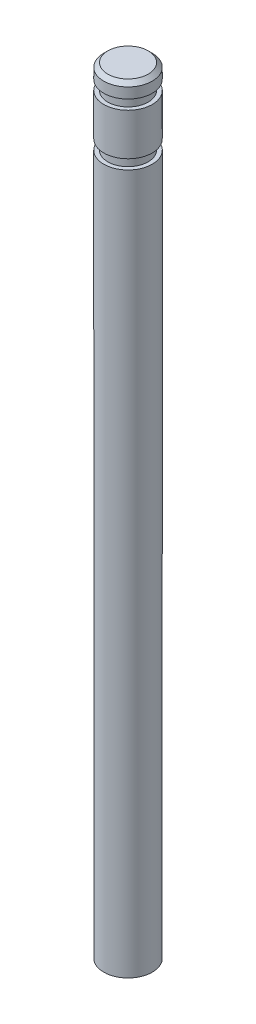
ISO-10303-21;
HEADER;
FILE_DESCRIPTION(('STEP AP214'),'2;1');
FILE_NAME('part.step','',(''),(''),'','','');
FILE_SCHEMA(('AUTOMOTIVE_DESIGN { 1 0 10303 214 1 1 1 1 }'));
ENDSEC;
DATA;
#1=APPLICATION_CONTEXT('core data for automotive mechanical design processes');
#2=APPLICATION_PROTOCOL_DEFINITION('international standard','automotive_design',2000,#1);
#3=PRODUCT_CONTEXT('',#1,'mechanical');
#4=PRODUCT('Part','Part','',(#3));
#5=PRODUCT_RELATED_PRODUCT_CATEGORY('part','',(#4));
#6=PRODUCT_DEFINITION_FORMATION('','',#4);
#7=PRODUCT_DEFINITION_CONTEXT('part definition',#1,'design');
#8=PRODUCT_DEFINITION('design','',#6,#7);
#9=PRODUCT_DEFINITION_SHAPE('','',#8);
#10=(LENGTH_UNIT() NAMED_UNIT(*) SI_UNIT(.MILLI.,.METRE.));
#11=(NAMED_UNIT(*) PLANE_ANGLE_UNIT() SI_UNIT($,.RADIAN.));
#12=(NAMED_UNIT(*) SI_UNIT($,.STERADIAN.) SOLID_ANGLE_UNIT());
#13=UNCERTAINTY_MEASURE_WITH_UNIT(LENGTH_MEASURE(1.E-05),#10,'distance_accuracy_value','');
#14=(GEOMETRIC_REPRESENTATION_CONTEXT(3) GLOBAL_UNCERTAINTY_ASSIGNED_CONTEXT((#13)) GLOBAL_UNIT_ASSIGNED_CONTEXT((#10,
#11,#12)) REPRESENTATION_CONTEXT('',''));
#15=CARTESIAN_POINT('',(0.,0.,0.));
#16=DIRECTION('',(0.,0.,1.));
#17=DIRECTION('',(1.,0.,0.));
#18=AXIS2_PLACEMENT_3D('',#15,#16,#17);
#19=CARTESIAN_POINT('',(0.,48.,0.));
#20=DIRECTION('',(0.,-1.,0.));
#21=DIRECTION('',(0.,0.,-1.));
#22=AXIS2_PLACEMENT_3D('',#19,#20,#21);
#23=CYLINDRICAL_SURFACE('',#22,1.5);
#24=CARTESIAN_POINT('',(0.,43.9,0.));
#25=DIRECTION('',(0.,-1.,0.));
#26=DIRECTION('',(0.,0.,-1.));
#27=AXIS2_PLACEMENT_3D('',#24,#25,#26);
#28=CIRCLE('',#27,1.5);
#29=CARTESIAN_POINT('',(0.,43.9,-1.5));
#30=VERTEX_POINT('',#29);
#31=EDGE_CURVE('E52',#30,#30,#28,.T.);
#32=ORIENTED_EDGE('',*,*,#31,.F.);
#33=EDGE_LOOP('',(#32));
#34=FACE_BOUND('',#33,.T.);
#35=CARTESIAN_POINT('',(0.,46.5,0.));
#36=DIRECTION('',(0.,-1.,0.));
#37=DIRECTION('',(0.,0.,-1.));
#38=AXIS2_PLACEMENT_3D('',#35,#36,#37);
#39=CIRCLE('',#38,1.5);
#40=CARTESIAN_POINT('',(0.,46.5,-1.5));
#41=VERTEX_POINT('',#40);
#42=EDGE_CURVE('E29',#41,#41,#39,.T.);
#43=ORIENTED_EDGE('',*,*,#42,.T.);
#44=EDGE_LOOP('',(#43));
#45=FACE_BOUND('',#44,.T.);
#46=ADVANCED_FACE('F14',(#34,#45),#23,.T.);
#47=CARTESIAN_POINT('',(1.5,46.5,0.));
#48=DIRECTION('',(0.,-1.,0.));
#49=DIRECTION('',(0.,0.,-1.));
#50=AXIS2_PLACEMENT_3D('',#47,#48,#49);
#51=PLANE('',#50);
#52=ORIENTED_EDGE('',*,*,#42,.F.);
#53=EDGE_LOOP('',(#52));
#54=FACE_BOUND('',#53,.T.);
#55=CARTESIAN_POINT('',(0.,46.5,0.));
#56=DIRECTION('',(0.,-1.,0.));
#57=DIRECTION('',(0.,0.,-1.));
#58=AXIS2_PLACEMENT_3D('',#55,#56,#57);
#59=CIRCLE('',#58,1.25);
#60=CARTESIAN_POINT('',(0.,46.5,-1.25));
#61=VERTEX_POINT('',#60);
#62=EDGE_CURVE('E34',#61,#61,#59,.T.);
#63=ORIENTED_EDGE('',*,*,#62,.T.);
#64=EDGE_LOOP('',(#63));
#65=FACE_BOUND('',#64,.T.);
#66=ADVANCED_FACE('F60',(#54,#65),#51,.F.);
#67=CARTESIAN_POINT('',(0.,0.,0.));
#68=DIRECTION('',(0.,-1.,0.));
#69=DIRECTION('',(0.,0.,-1.));
#70=AXIS2_PLACEMENT_3D('',#67,#68,#69);
#71=CYLINDRICAL_SURFACE('',#70,1.25);
#72=ORIENTED_EDGE('',*,*,#62,.F.);
#73=EDGE_LOOP('',(#72));
#74=FACE_BOUND('',#73,.T.);
#75=CARTESIAN_POINT('',(0.,47.1,0.));
#76=DIRECTION('',(0.,-1.,0.));
#77=DIRECTION('',(0.,0.,-1.));
#78=AXIS2_PLACEMENT_3D('',#75,#76,#77);
#79=CIRCLE('',#78,1.25);
#80=CARTESIAN_POINT('',(0.,47.1,-1.25));
#81=VERTEX_POINT('',#80);
#82=EDGE_CURVE('E37',#81,#81,#79,.T.);
#83=ORIENTED_EDGE('',*,*,#82,.T.);
#84=EDGE_LOOP('',(#83));
#85=FACE_BOUND('',#84,.T.);
#86=ADVANCED_FACE('F67',(#74,#85),#71,.T.);
#87=CARTESIAN_POINT('',(1.5,47.1,0.));
#88=DIRECTION('',(0.,1.,0.));
#89=DIRECTION('',(0.,0.,1.));
#90=AXIS2_PLACEMENT_3D('',#87,#88,#89);
#91=PLANE('',#90);
#92=ORIENTED_EDGE('',*,*,#82,.F.);
#93=EDGE_LOOP('',(#92));
#94=FACE_BOUND('',#93,.T.);
#95=CARTESIAN_POINT('',(0.,47.1,0.));
#96=DIRECTION('',(0.,-1.,0.));
#97=DIRECTION('',(0.,0.,-1.));
#98=AXIS2_PLACEMENT_3D('',#95,#96,#97);
#99=CIRCLE('',#98,1.5);
#100=CARTESIAN_POINT('',(0.,47.1,-1.5));
#101=VERTEX_POINT('',#100);
#102=EDGE_CURVE('E40',#101,#101,#99,.T.);
#103=ORIENTED_EDGE('',*,*,#102,.T.);
#104=EDGE_LOOP('',(#103));
#105=FACE_BOUND('',#104,.T.);
#106=ADVANCED_FACE('F73',(#94,#105),#91,.F.);
#107=CARTESIAN_POINT('',(0.,48.,0.));
#108=DIRECTION('',(0.,1.,0.));
#109=DIRECTION('',(0.,0.,1.));
#110=AXIS2_PLACEMENT_3D('',#107,#108,#109);
#111=PLANE('',#110);
#112=CARTESIAN_POINT('',(0.,48.,0.));
#113=DIRECTION('',(0.,1.,0.));
#114=DIRECTION('',(0.,0.,1.));
#115=AXIS2_PLACEMENT_3D('',#112,#113,#114);
#116=CIRCLE('',#115,1.25);
#117=CARTESIAN_POINT('',(0.,48.,1.25));
#118=VERTEX_POINT('',#117);
#119=EDGE_CURVE('E21',#118,#118,#116,.T.);
#120=ORIENTED_EDGE('',*,*,#119,.T.);
#121=EDGE_LOOP('',(#120));
#122=FACE_BOUND('',#121,.T.);
#123=ADVANCED_FACE('F79',(#122),#111,.T.);
#124=CARTESIAN_POINT('',(0.,47.75,0.));
#125=DIRECTION('',(0.,1.,0.));
#126=DIRECTION('',(0.,0.,1.));
#127=AXIS2_PLACEMENT_3D('',#124,#125,#126);
#128=CIRCLE('',#127,1.5);
#129=CARTESIAN_POINT('',(0.,47.75,1.5));
#130=VERTEX_POINT('',#129);
#131=EDGE_CURVE('E10',#130,#130,#128,.F.);
#132=ORIENTED_EDGE('',*,*,#131,.T.);
#133=EDGE_LOOP('',(#132));
#134=FACE_BOUND('',#133,.T.);
#135=ORIENTED_EDGE('',*,*,#102,.F.);
#136=EDGE_LOOP('',(#135));
#137=FACE_BOUND('',#136,.T.);
#138=ADVANCED_FACE('F61',(#134,#137),#23,.T.);
#139=CARTESIAN_POINT('',(1.5,43.3,0.));
#140=DIRECTION('',(0.,-1.,0.));
#141=DIRECTION('',(0.,0.,-1.));
#142=AXIS2_PLACEMENT_3D('',#139,#140,#141);
#143=PLANE('',#142);
#144=CARTESIAN_POINT('',(0.,43.3,0.));
#145=DIRECTION('',(0.,-1.,0.));
#146=DIRECTION('',(0.,0.,-1.));
#147=AXIS2_PLACEMENT_3D('',#144,#145,#146);
#148=CIRCLE('',#147,1.5);
#149=CARTESIAN_POINT('',(0.,43.3,-1.5));
#150=VERTEX_POINT('',#149);
#151=EDGE_CURVE('E43',#150,#150,#148,.T.);
#152=ORIENTED_EDGE('',*,*,#151,.F.);
#153=EDGE_LOOP('',(#152));
#154=FACE_BOUND('',#153,.T.);
#155=CARTESIAN_POINT('',(0.,43.3,0.));
#156=DIRECTION('',(0.,-1.,0.));
#157=DIRECTION('',(0.,0.,-1.));
#158=AXIS2_PLACEMENT_3D('',#155,#156,#157);
#159=CIRCLE('',#158,1.25);
#160=CARTESIAN_POINT('',(0.,43.3,-1.25));
#161=VERTEX_POINT('',#160);
#162=EDGE_CURVE('E46',#161,#161,#159,.T.);
#163=ORIENTED_EDGE('',*,*,#162,.T.);
#164=EDGE_LOOP('',(#163));
#165=FACE_BOUND('',#164,.T.);
#166=ADVANCED_FACE('F84',(#154,#165),#143,.F.);
#167=CARTESIAN_POINT('',(0.,0.,0.));
#168=DIRECTION('',(0.,-1.,0.));
#169=DIRECTION('',(0.,0.,-1.));
#170=AXIS2_PLACEMENT_3D('',#167,#168,#169);
#171=CYLINDRICAL_SURFACE('',#170,1.25);
#172=ORIENTED_EDGE('',*,*,#162,.F.);
#173=EDGE_LOOP('',(#172));
#174=FACE_BOUND('',#173,.T.);
#175=CARTESIAN_POINT('',(0.,43.9,0.));
#176=DIRECTION('',(0.,-1.,0.));
#177=DIRECTION('',(0.,0.,-1.));
#178=AXIS2_PLACEMENT_3D('',#175,#176,#177);
#179=CIRCLE('',#178,1.25);
#180=CARTESIAN_POINT('',(0.,43.9,-1.25));
#181=VERTEX_POINT('',#180);
#182=EDGE_CURVE('E49',#181,#181,#179,.T.);
#183=ORIENTED_EDGE('',*,*,#182,.T.);
#184=EDGE_LOOP('',(#183));
#185=FACE_BOUND('',#184,.T.);
#186=ADVANCED_FACE('F90',(#174,#185),#171,.T.);
#187=CARTESIAN_POINT('',(1.5,43.9,0.));
#188=DIRECTION('',(0.,1.,0.));
#189=DIRECTION('',(0.,0.,1.));
#190=AXIS2_PLACEMENT_3D('',#187,#188,#189);
#191=PLANE('',#190);
#192=ORIENTED_EDGE('',*,*,#182,.F.);
#193=EDGE_LOOP('',(#192));
#194=FACE_BOUND('',#193,.T.);
#195=ORIENTED_EDGE('',*,*,#31,.T.);
#196=EDGE_LOOP('',(#195));
#197=FACE_BOUND('',#196,.T.);
#198=ADVANCED_FACE('F56',(#194,#197),#191,.F.);
#199=CARTESIAN_POINT('',(0.,0.,0.));
#200=DIRECTION('',(0.,1.,0.));
#201=DIRECTION('',(0.,0.,1.));
#202=AXIS2_PLACEMENT_3D('',#199,#200,#201);
#203=PLANE('',#202);
#204=CARTESIAN_POINT('',(0.,0.,0.));
#205=DIRECTION('',(0.,1.,0.));
#206=DIRECTION('',(0.,0.,1.));
#207=AXIS2_PLACEMENT_3D('',#204,#205,#206);
#208=CIRCLE('',#207,1.5);
#209=CARTESIAN_POINT('',(0.,0.,1.5));
#210=VERTEX_POINT('',#209);
#211=EDGE_CURVE('E25',#210,#210,#208,.T.);
#212=ORIENTED_EDGE('',*,*,#211,.F.);
#213=EDGE_LOOP('',(#212));
#214=FACE_BOUND('',#213,.T.);
#215=ADVANCED_FACE('F96',(#214),#203,.F.);
#216=ORIENTED_EDGE('',*,*,#151,.T.);
#217=EDGE_LOOP('',(#216));
#218=FACE_BOUND('',#217,.T.);
#219=ORIENTED_EDGE('',*,*,#211,.T.);
#220=EDGE_LOOP('',(#219));
#221=FACE_BOUND('',#220,.T.);
#222=ADVANCED_FACE('F62',(#218,#221),#23,.T.);
#223=CARTESIAN_POINT('',(0.,48.,0.));
#224=DIRECTION('',(0.,-1.,0.));
#225=DIRECTION('',(0.,0.,-1.));
#226=AXIS2_PLACEMENT_3D('',#223,#224,#225);
#227=CONICAL_SURFACE('',#226,1.25,0.785398163397448);
#228=ORIENTED_EDGE('',*,*,#131,.F.);
#229=EDGE_LOOP('',(#228));
#230=FACE_BOUND('',#229,.T.);
#231=ORIENTED_EDGE('',*,*,#119,.F.);
#232=EDGE_LOOP('',(#231));
#233=FACE_BOUND('',#232,.T.);
#234=ADVANCED_FACE('F16',(#230,#233),#227,.T.);
#235=CLOSED_SHELL('',(#46,#66,#86,#106,#123,#138,#166,#186,#198,#215,#222,#234));
#236=MANIFOLD_SOLID_BREP('B1',#235);
#237=ADVANCED_BREP_SHAPE_REPRESENTATION('',(#18,#236),#14);
#238=SHAPE_DEFINITION_REPRESENTATION(#9,#237);
ENDSEC;
END-ISO-10303-21;
